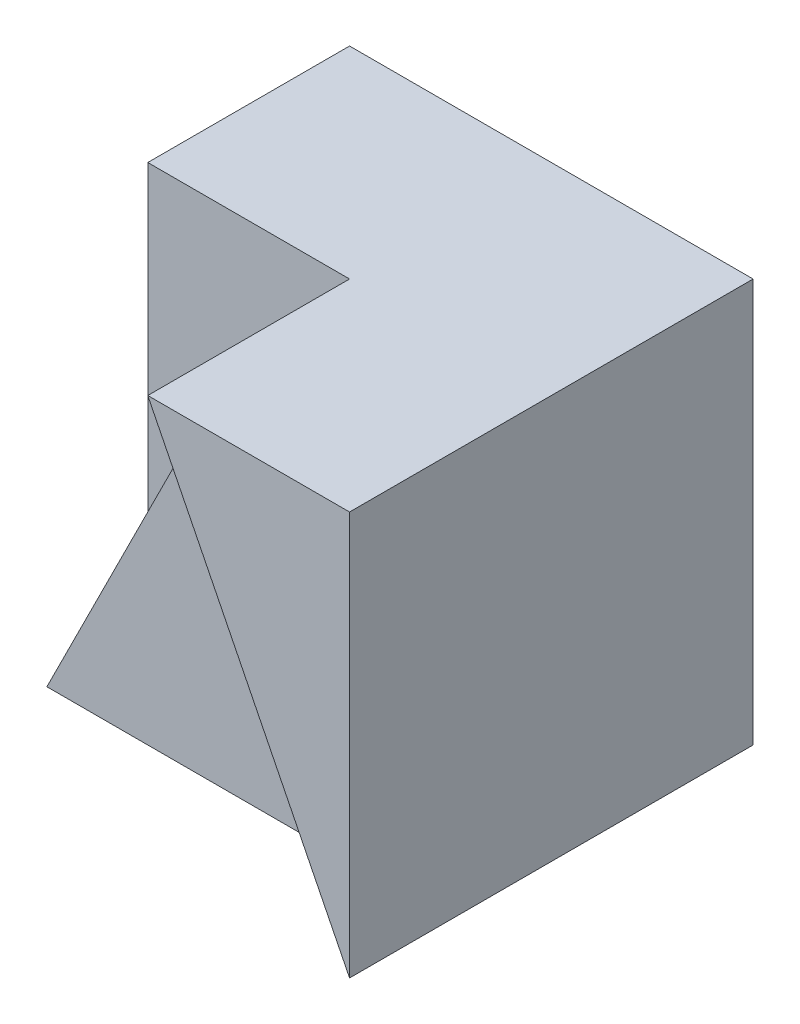
ISO-10303-21;
HEADER;
FILE_DESCRIPTION(('STEP AP214'),'2;1');
FILE_NAME('part.step','',(''),(''),'','','');
FILE_SCHEMA(('AUTOMOTIVE_DESIGN { 1 0 10303 214 1 1 1 1 }'));
ENDSEC;
DATA;
#1=APPLICATION_CONTEXT('core data for automotive mechanical design processes');
#2=APPLICATION_PROTOCOL_DEFINITION('international standard','automotive_design',2000,#1);
#3=PRODUCT_CONTEXT('',#1,'mechanical');
#4=PRODUCT('Part','Part','',(#3));
#5=PRODUCT_RELATED_PRODUCT_CATEGORY('part','',(#4));
#6=PRODUCT_DEFINITION_FORMATION('','',#4);
#7=PRODUCT_DEFINITION_CONTEXT('part definition',#1,'design');
#8=PRODUCT_DEFINITION('design','',#6,#7);
#9=PRODUCT_DEFINITION_SHAPE('','',#8);
#10=(LENGTH_UNIT() NAMED_UNIT(*) SI_UNIT(.MILLI.,.METRE.));
#11=(NAMED_UNIT(*) PLANE_ANGLE_UNIT() SI_UNIT($,.RADIAN.));
#12=(NAMED_UNIT(*) SI_UNIT($,.STERADIAN.) SOLID_ANGLE_UNIT());
#13=UNCERTAINTY_MEASURE_WITH_UNIT(LENGTH_MEASURE(1.E-05),#10,'distance_accuracy_value','');
#14=(GEOMETRIC_REPRESENTATION_CONTEXT(3) GLOBAL_UNCERTAINTY_ASSIGNED_CONTEXT((#13)) GLOBAL_UNIT_ASSIGNED_CONTEXT((#10,
#11,#12)) REPRESENTATION_CONTEXT('',''));
#15=CARTESIAN_POINT('',(0.,0.,0.));
#16=DIRECTION('',(0.,0.,1.));
#17=DIRECTION('',(1.,0.,0.));
#18=AXIS2_PLACEMENT_3D('',#15,#16,#17);
#19=CARTESIAN_POINT('',(-2.,4.,2.));
#20=DIRECTION('',(1.,0.,0.));
#21=DIRECTION('',(0.,0.,-1.));
#22=AXIS2_PLACEMENT_3D('',#19,#20,#21);
#23=PLANE('',#22);
#24=DIRECTION('',(0.,-1.,0.));
#25=VECTOR('',#24,1.);
#26=CARTESIAN_POINT('',(-2.,4.,0.));
#27=LINE('',#26,#25);
#28=CARTESIAN_POINT('',(-2.,4.,0.));
#29=VERTEX_POINT('',#28);
#30=CARTESIAN_POINT('',(-2.,0.,0.));
#31=VERTEX_POINT('',#30);
#32=EDGE_CURVE('E56',#29,#31,#27,.T.);
#33=ORIENTED_EDGE('',*,*,#32,.F.);
#34=DIRECTION('',(0.,0.,1.));
#35=VECTOR('',#34,1.);
#36=CARTESIAN_POINT('',(-2.,4.,2.));
#37=LINE('',#36,#35);
#38=CARTESIAN_POINT('',(-2.,4.,-2.));
#39=VERTEX_POINT('',#38);
#40=EDGE_CURVE('E124',#39,#29,#37,.T.);
#41=ORIENTED_EDGE('',*,*,#40,.F.);
#42=DIRECTION('',(0.,-1.,0.));
#43=VECTOR('',#42,1.);
#44=CARTESIAN_POINT('',(-2.,4.,-2.));
#45=LINE('',#44,#43);
#46=CARTESIAN_POINT('',(-2.,0.,-2.));
#47=VERTEX_POINT('',#46);
#48=EDGE_CURVE('E41',#39,#47,#45,.T.);
#49=ORIENTED_EDGE('',*,*,#48,.T.);
#50=DIRECTION('',(0.,0.,1.));
#51=VECTOR('',#50,1.);
#52=CARTESIAN_POINT('',(-2.,0.,2.));
#53=LINE('',#52,#51);
#54=EDGE_CURVE('E122',#47,#31,#53,.T.);
#55=ORIENTED_EDGE('',*,*,#54,.T.);
#56=EDGE_LOOP('',(#33,#41,#49,#55));
#57=FACE_BOUND('',#56,.T.);
#58=ADVANCED_FACE('F33',(#57),#23,.F.);
#59=CARTESIAN_POINT('',(2.,4.,2.));
#60=DIRECTION('',(-1.,0.,0.));
#61=DIRECTION('',(0.,0.,1.));
#62=AXIS2_PLACEMENT_3D('',#59,#60,#61);
#63=PLANE('',#62);
#64=DIRECTION('',(0.,0.,-1.));
#65=VECTOR('',#64,1.);
#66=CARTESIAN_POINT('',(2.,0.,2.));
#67=LINE('',#66,#65);
#68=CARTESIAN_POINT('',(2.,0.,2.));
#69=VERTEX_POINT('',#68);
#70=CARTESIAN_POINT('',(2.,0.,1.));
#71=VERTEX_POINT('',#70);
#72=EDGE_CURVE('E112',#69,#71,#67,.T.);
#73=ORIENTED_EDGE('',*,*,#72,.T.);
#74=CARTESIAN_POINT('',(2.,0.,-2.));
#75=VERTEX_POINT('',#74);
#76=EDGE_CURVE('E104',#71,#75,#67,.T.);
#77=ORIENTED_EDGE('',*,*,#76,.T.);
#78=DIRECTION('',(0.,-1.,0.));
#79=VECTOR('',#78,1.);
#80=CARTESIAN_POINT('',(2.,4.,-2.));
#81=LINE('',#80,#79);
#82=CARTESIAN_POINT('',(2.,4.,-2.));
#83=VERTEX_POINT('',#82);
#84=EDGE_CURVE('E11',#83,#75,#81,.T.);
#85=ORIENTED_EDGE('',*,*,#84,.F.);
#86=DIRECTION('',(0.,0.,-1.));
#87=VECTOR('',#86,1.);
#88=CARTESIAN_POINT('',(2.,4.,2.));
#89=LINE('',#88,#87);
#90=CARTESIAN_POINT('',(2.,4.,2.));
#91=VERTEX_POINT('',#90);
#92=EDGE_CURVE('E118',#91,#83,#89,.T.);
#93=ORIENTED_EDGE('',*,*,#92,.F.);
#94=DIRECTION('',(0.,-1.,0.));
#95=VECTOR('',#94,1.);
#96=CARTESIAN_POINT('',(2.,4.,2.));
#97=LINE('',#96,#95);
#98=EDGE_CURVE('E128',#91,#69,#97,.T.);
#99=ORIENTED_EDGE('',*,*,#98,.T.);
#100=EDGE_LOOP('',(#73,#77,#85,#93,#99));
#101=FACE_BOUND('',#100,.T.);
#102=ADVANCED_FACE('F35',(#101),#63,.F.);
#103=CARTESIAN_POINT('',(-2.,4.,-2.));
#104=DIRECTION('',(0.,0.,1.));
#105=DIRECTION('',(1.,0.,0.));
#106=AXIS2_PLACEMENT_3D('',#103,#104,#105);
#107=PLANE('',#106);
#108=DIRECTION('',(-1.,0.,0.));
#109=VECTOR('',#108,1.);
#110=CARTESIAN_POINT('',(-2.,0.,-2.));
#111=LINE('',#110,#109);
#112=EDGE_CURVE('E130',#75,#47,#111,.T.);
#113=ORIENTED_EDGE('',*,*,#112,.T.);
#114=ORIENTED_EDGE('',*,*,#48,.F.);
#115=DIRECTION('',(-1.,0.,0.));
#116=VECTOR('',#115,1.);
#117=CARTESIAN_POINT('',(-2.,4.,-2.));
#118=LINE('',#117,#116);
#119=EDGE_CURVE('E121',#83,#39,#118,.T.);
#120=ORIENTED_EDGE('',*,*,#119,.F.);
#121=ORIENTED_EDGE('',*,*,#84,.T.);
#122=EDGE_LOOP('',(#113,#114,#120,#121));
#123=FACE_BOUND('',#122,.T.);
#124=ADVANCED_FACE('F140',(#123),#107,.F.);
#125=CARTESIAN_POINT('',(-2.,4.,2.));
#126=DIRECTION('',(0.,0.,-1.));
#127=DIRECTION('',(-1.,0.,0.));
#128=AXIS2_PLACEMENT_3D('',#125,#126,#127);
#129=PLANE('',#128);
#130=DIRECTION('',(1.,0.,0.));
#131=VECTOR('',#130,1.);
#132=CARTESIAN_POINT('',(-2.,4.,2.));
#133=LINE('',#132,#131);
#134=CARTESIAN_POINT('',(0.,4.,2.));
#135=VERTEX_POINT('',#134);
#136=EDGE_CURVE('E127',#135,#91,#133,.T.);
#137=ORIENTED_EDGE('',*,*,#136,.F.);
#138=DIRECTION('',(-0.447213595499958,0.894427190999916,0.));
#139=VECTOR('',#138,1.);
#140=CARTESIAN_POINT('',(2.,0.,2.));
#141=LINE('',#140,#139);
#142=EDGE_CURVE('E147',#69,#135,#141,.T.);
#143=ORIENTED_EDGE('',*,*,#142,.F.);
#144=ORIENTED_EDGE('',*,*,#98,.F.);
#145=EDGE_LOOP('',(#137,#143,#144));
#146=FACE_BOUND('',#145,.T.);
#147=ADVANCED_FACE('F151',(#146),#129,.F.);
#148=CARTESIAN_POINT('',(0.,4.,0.));
#149=DIRECTION('',(0.,-1.,0.));
#150=DIRECTION('',(0.,0.,-1.));
#151=AXIS2_PLACEMENT_3D('',#148,#149,#150);
#152=PLANE('',#151);
#153=DIRECTION('',(-1.,0.,0.));
#154=VECTOR('',#153,1.);
#155=CARTESIAN_POINT('',(0.,4.,0.));
#156=LINE('',#155,#154);
#157=CARTESIAN_POINT('',(0.,4.,0.));
#158=VERTEX_POINT('',#157);
#159=EDGE_CURVE('E156',#158,#29,#156,.T.);
#160=ORIENTED_EDGE('',*,*,#159,.F.);
#161=DIRECTION('',(0.,0.,1.));
#162=VECTOR('',#161,1.);
#163=CARTESIAN_POINT('',(0.,4.,0.));
#164=LINE('',#163,#162);
#165=CARTESIAN_POINT('',(0.,4.,1.));
#166=VERTEX_POINT('',#165);
#167=EDGE_CURVE('E110',#158,#166,#164,.T.);
#168=ORIENTED_EDGE('',*,*,#167,.T.);
#169=DIRECTION('',(0.,0.,1.));
#170=VECTOR('',#169,1.);
#171=CARTESIAN_POINT('',(0.,4.,1.));
#172=LINE('',#171,#170);
#173=EDGE_CURVE('E106',#166,#135,#172,.T.);
#174=ORIENTED_EDGE('',*,*,#173,.T.);
#175=ORIENTED_EDGE('',*,*,#136,.T.);
#176=ORIENTED_EDGE('',*,*,#92,.T.);
#177=ORIENTED_EDGE('',*,*,#119,.T.);
#178=ORIENTED_EDGE('',*,*,#40,.T.);
#179=EDGE_LOOP('',(#160,#168,#174,#175,#176,#177,#178));
#180=FACE_BOUND('',#179,.T.);
#181=ADVANCED_FACE('F160',(#180),#152,.F.);
#182=CARTESIAN_POINT('',(0.,0.,0.));
#183=DIRECTION('',(0.,-1.,0.));
#184=DIRECTION('',(0.,0.,-1.));
#185=AXIS2_PLACEMENT_3D('',#182,#183,#184);
#186=PLANE('',#185);
#187=DIRECTION('',(1.,0.,0.));
#188=VECTOR('',#187,1.);
#189=CARTESIAN_POINT('',(-2.,0.,1.));
#190=LINE('',#189,#188);
#191=CARTESIAN_POINT('',(-2.,0.,1.));
#192=VERTEX_POINT('',#191);
#193=EDGE_CURVE('E91',#192,#71,#190,.T.);
#194=ORIENTED_EDGE('',*,*,#193,.F.);
#195=DIRECTION('',(0.,0.,1.));
#196=VECTOR('',#195,1.);
#197=CARTESIAN_POINT('',(-2.,0.,0.));
#198=LINE('',#197,#196);
#199=EDGE_CURVE('E101',#31,#192,#198,.T.);
#200=ORIENTED_EDGE('',*,*,#199,.F.);
#201=ORIENTED_EDGE('',*,*,#54,.F.);
#202=ORIENTED_EDGE('',*,*,#112,.F.);
#203=ORIENTED_EDGE('',*,*,#76,.F.);
#204=EDGE_LOOP('',(#194,#200,#201,#202,#203));
#205=FACE_BOUND('',#204,.T.);
#206=ADVANCED_FACE('F99',(#205),#186,.T.);
#207=CARTESIAN_POINT('',(-2.,0.,0.));
#208=DIRECTION('',(0.894427190999916,-0.447213595499958,0.));
#209=DIRECTION('',(0.447213595499958,0.894427190999916,0.));
#210=AXIS2_PLACEMENT_3D('',#207,#208,#209);
#211=PLANE('',#210);
#212=ORIENTED_EDGE('',*,*,#199,.T.);
#213=DIRECTION('',(-0.447213595499958,-0.894427190999916,0.));
#214=VECTOR('',#213,1.);
#215=CARTESIAN_POINT('',(0.,4.,1.));
#216=LINE('',#215,#214);
#217=EDGE_CURVE('E88',#166,#192,#216,.T.);
#218=ORIENTED_EDGE('',*,*,#217,.F.);
#219=ORIENTED_EDGE('',*,*,#167,.F.);
#220=DIRECTION('',(0.447213595499958,0.894427190999916,0.));
#221=VECTOR('',#220,1.);
#222=CARTESIAN_POINT('',(-2.,0.,0.));
#223=LINE('',#222,#221);
#224=EDGE_CURVE('E109',#31,#158,#223,.T.);
#225=ORIENTED_EDGE('',*,*,#224,.F.);
#226=EDGE_LOOP('',(#212,#218,#219,#225));
#227=FACE_BOUND('',#226,.T.);
#228=ADVANCED_FACE('F108',(#227),#211,.F.);
#229=CARTESIAN_POINT('',(0.,0.,0.));
#230=DIRECTION('',(0.,0.,1.));
#231=DIRECTION('',(1.,0.,0.));
#232=AXIS2_PLACEMENT_3D('',#229,#230,#231);
#233=PLANE('',#232);
#234=ORIENTED_EDGE('',*,*,#224,.T.);
#235=ORIENTED_EDGE('',*,*,#159,.T.);
#236=ORIENTED_EDGE('',*,*,#32,.T.);
#237=EDGE_LOOP('',(#234,#235,#236));
#238=FACE_BOUND('',#237,.T.);
#239=ADVANCED_FACE('F158',(#238),#233,.T.);
#240=CARTESIAN_POINT('',(2.,0.,1.));
#241=DIRECTION('',(0.894427190999916,0.447213595499958,0.));
#242=DIRECTION('',(-0.447213595499958,0.894427190999916,0.));
#243=AXIS2_PLACEMENT_3D('',#240,#241,#242);
#244=PLANE('',#243);
#245=ORIENTED_EDGE('',*,*,#142,.T.);
#246=ORIENTED_EDGE('',*,*,#173,.F.);
#247=DIRECTION('',(-0.447213595499958,0.894427190999916,0.));
#248=VECTOR('',#247,1.);
#249=CARTESIAN_POINT('',(2.,0.,1.));
#250=LINE('',#249,#248);
#251=EDGE_CURVE('E48',#71,#166,#250,.T.);
#252=ORIENTED_EDGE('',*,*,#251,.F.);
#253=ORIENTED_EDGE('',*,*,#72,.F.);
#254=EDGE_LOOP('',(#245,#246,#252,#253));
#255=FACE_BOUND('',#254,.T.);
#256=ADVANCED_FACE('F146',(#255),#244,.F.);
#257=CARTESIAN_POINT('',(0.,0.,1.));
#258=DIRECTION('',(0.,0.,-1.));
#259=DIRECTION('',(-1.,0.,0.));
#260=AXIS2_PLACEMENT_3D('',#257,#258,#259);
#261=PLANE('',#260);
#262=ORIENTED_EDGE('',*,*,#251,.T.);
#263=ORIENTED_EDGE('',*,*,#217,.T.);
#264=ORIENTED_EDGE('',*,*,#193,.T.);
#265=EDGE_LOOP('',(#262,#263,#264));
#266=FACE_BOUND('',#265,.T.);
#267=ADVANCED_FACE('F90',(#266),#261,.F.);
#268=CLOSED_SHELL('',(#58,#102,#124,#147,#181,#206,#228,#239,#256,#267));
#269=MANIFOLD_SOLID_BREP('B2',#268);
#270=ADVANCED_BREP_SHAPE_REPRESENTATION('',(#18,#269),#14);
#271=SHAPE_DEFINITION_REPRESENTATION(#9,#270);
ENDSEC;
END-ISO-10303-21;
